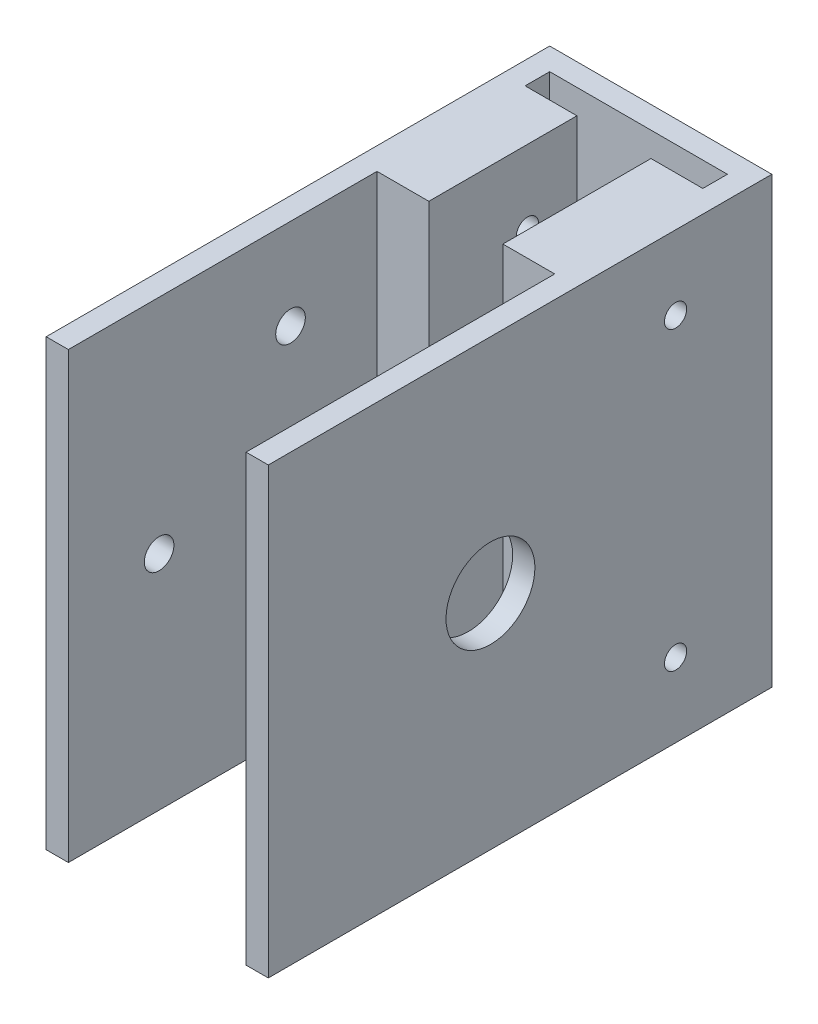
ISO-10303-21;
HEADER;
FILE_DESCRIPTION(('STEP AP214'),'2;1');
FILE_NAME('part.step','',(''),(''),'','','');
FILE_SCHEMA(('AUTOMOTIVE_DESIGN { 1 0 10303 214 1 1 1 1 }'));
ENDSEC;
DATA;
#1=APPLICATION_CONTEXT('core data for automotive mechanical design processes');
#2=APPLICATION_PROTOCOL_DEFINITION('international standard','automotive_design',2000,#1);
#3=PRODUCT_CONTEXT('',#1,'mechanical');
#4=PRODUCT('Part','Part','',(#3));
#5=PRODUCT_RELATED_PRODUCT_CATEGORY('part','',(#4));
#6=PRODUCT_DEFINITION_FORMATION('','',#4);
#7=PRODUCT_DEFINITION_CONTEXT('part definition',#1,'design');
#8=PRODUCT_DEFINITION('design','',#6,#7);
#9=PRODUCT_DEFINITION_SHAPE('','',#8);
#10=(LENGTH_UNIT() NAMED_UNIT(*) SI_UNIT(.MILLI.,.METRE.));
#11=(NAMED_UNIT(*) PLANE_ANGLE_UNIT() SI_UNIT($,.RADIAN.));
#12=(NAMED_UNIT(*) SI_UNIT($,.STERADIAN.) SOLID_ANGLE_UNIT());
#13=UNCERTAINTY_MEASURE_WITH_UNIT(LENGTH_MEASURE(1.E-05),#10,'distance_accuracy_value','');
#14=(GEOMETRIC_REPRESENTATION_CONTEXT(3) GLOBAL_UNCERTAINTY_ASSIGNED_CONTEXT((#13)) GLOBAL_UNIT_ASSIGNED_CONTEXT((#10,
#11,#12)) REPRESENTATION_CONTEXT('',''));
#15=CARTESIAN_POINT('',(0.,0.,0.));
#16=DIRECTION('',(0.,0.,1.));
#17=DIRECTION('',(1.,0.,0.));
#18=AXIS2_PLACEMENT_3D('',#15,#16,#17);
#19=CARTESIAN_POINT('',(-12.,30.,68.));
#20=DIRECTION('',(-1.,0.,0.));
#21=DIRECTION('',(0.,-1.,0.));
#22=AXIS2_PLACEMENT_3D('',#19,#20,#21);
#23=PLANE('',#22);
#24=DIRECTION('',(0.,1.,0.));
#25=VECTOR('',#24,1.);
#26=CARTESIAN_POINT('',(-12.,-51.1896201004171,6.32013899553956));
#27=LINE('',#26,#25);
#28=CARTESIAN_POINT('',(-12.,-30.,6.32013899553956));
#29=VERTEX_POINT('',#28);
#30=CARTESIAN_POINT('',(-12.,30.,6.32013899553956));
#31=VERTEX_POINT('',#30);
#32=EDGE_CURVE('E165',#29,#31,#27,.T.);
#33=ORIENTED_EDGE('',*,*,#32,.F.);
#34=DIRECTION('',(0.,0.,-1.));
#35=VECTOR('',#34,1.);
#36=CARTESIAN_POINT('',(-12.,-30.,68.));
#37=LINE('',#36,#35);
#38=CARTESIAN_POINT('',(-12.,-30.,3.));
#39=VERTEX_POINT('',#38);
#40=EDGE_CURVE('E253',#29,#39,#37,.T.);
#41=ORIENTED_EDGE('',*,*,#40,.T.);
#42=DIRECTION('',(0.,1.,0.));
#43=VECTOR('',#42,1.);
#44=CARTESIAN_POINT('',(-12.,30.,3.));
#45=LINE('',#44,#43);
#46=CARTESIAN_POINT('',(-12.,30.,3.));
#47=VERTEX_POINT('',#46);
#48=EDGE_CURVE('E239',#39,#47,#45,.T.);
#49=ORIENTED_EDGE('',*,*,#48,.T.);
#50=DIRECTION('',(0.,0.,-1.));
#51=VECTOR('',#50,1.);
#52=CARTESIAN_POINT('',(-12.,30.,68.));
#53=LINE('',#52,#51);
#54=EDGE_CURVE('E62',#31,#47,#53,.T.);
#55=ORIENTED_EDGE('',*,*,#54,.F.);
#56=EDGE_LOOP('',(#33,#41,#49,#55));
#57=FACE_BOUND('',#56,.T.);
#58=ADVANCED_FACE('F39',(#57),#23,.F.);
#59=CARTESIAN_POINT('',(12.,30.,68.));
#60=DIRECTION('',(1.,0.,0.));
#61=DIRECTION('',(0.,1.,0.));
#62=AXIS2_PLACEMENT_3D('',#59,#60,#61);
#63=PLANE('',#62);
#64=CARTESIAN_POINT('',(12.,0.,38.));
#65=DIRECTION('',(1.,0.,0.));
#66=DIRECTION('',(0.,1.,0.));
#67=AXIS2_PLACEMENT_3D('',#64,#65,#66);
#68=CIRCLE('',#67,6.00000000000001);
#69=CARTESIAN_POINT('',(12.,6.00000000000001,38.));
#70=VERTEX_POINT('',#69);
#71=EDGE_CURVE('E350',#70,#70,#68,.T.);
#72=ORIENTED_EDGE('',*,*,#71,.T.);
#73=EDGE_LOOP('',(#72));
#74=FACE_BOUND('',#73,.T.);
#75=DIRECTION('',(0.,1.,0.));
#76=VECTOR('',#75,1.);
#77=CARTESIAN_POINT('',(12.,-51.1896201004171,26.3201389955396));
#78=LINE('',#77,#76);
#79=CARTESIAN_POINT('',(12.,-30.,26.3201389955396));
#80=VERTEX_POINT('',#79);
#81=CARTESIAN_POINT('',(12.,30.,26.3201389955396));
#82=VERTEX_POINT('',#81);
#83=EDGE_CURVE('E212',#80,#82,#78,.T.);
#84=ORIENTED_EDGE('',*,*,#83,.F.);
#85=DIRECTION('',(0.,0.,-1.));
#86=VECTOR('',#85,1.);
#87=CARTESIAN_POINT('',(12.,-30.,68.));
#88=LINE('',#87,#86);
#89=CARTESIAN_POINT('',(12.,-30.,68.));
#90=VERTEX_POINT('',#89);
#91=EDGE_CURVE('E232',#90,#80,#88,.T.);
#92=ORIENTED_EDGE('',*,*,#91,.F.);
#93=DIRECTION('',(0.,-1.,0.));
#94=VECTOR('',#93,1.);
#95=CARTESIAN_POINT('',(12.,30.,68.));
#96=LINE('',#95,#94);
#97=CARTESIAN_POINT('',(12.,30.,68.));
#98=VERTEX_POINT('',#97);
#99=EDGE_CURVE('E224',#98,#90,#96,.T.);
#100=ORIENTED_EDGE('',*,*,#99,.F.);
#101=DIRECTION('',(0.,0.,-1.));
#102=VECTOR('',#101,1.);
#103=CARTESIAN_POINT('',(12.,30.,68.));
#104=LINE('',#103,#102);
#105=EDGE_CURVE('E236',#98,#82,#104,.T.);
#106=ORIENTED_EDGE('',*,*,#105,.T.);
#107=EDGE_LOOP('',(#84,#92,#100,#106));
#108=FACE_BOUND('',#107,.T.);
#109=ADVANCED_FACE('F313',(#74,#108),#63,.F.);
#110=CARTESIAN_POINT('',(0.,0.,3.));
#111=DIRECTION('',(0.,0.,1.));
#112=DIRECTION('',(1.,0.,0.));
#113=AXIS2_PLACEMENT_3D('',#110,#111,#112);
#114=PLANE('',#113);
#115=CARTESIAN_POINT('',(0.,15.,3.));
#116=DIRECTION('',(0.,0.,1.));
#117=DIRECTION('',(1.,0.,0.));
#118=AXIS2_PLACEMENT_3D('',#115,#116,#117);
#119=CIRCLE('',#118,2.9);
#120=CARTESIAN_POINT('',(2.9,15.,3.));
#121=VERTEX_POINT('',#120);
#122=EDGE_CURVE('E262',#121,#121,#119,.T.);
#123=ORIENTED_EDGE('',*,*,#122,.F.);
#124=EDGE_LOOP('',(#123));
#125=FACE_BOUND('',#124,.T.);
#126=CARTESIAN_POINT('',(0.,-15.,3.));
#127=DIRECTION('',(0.,0.,1.));
#128=DIRECTION('',(-1.,0.,0.));
#129=AXIS2_PLACEMENT_3D('',#126,#127,#128);
#130=CIRCLE('',#129,2.9);
#131=CARTESIAN_POINT('',(-2.9,-15.,3.));
#132=VERTEX_POINT('',#131);
#133=EDGE_CURVE('E256',#132,#132,#130,.T.);
#134=ORIENTED_EDGE('',*,*,#133,.F.);
#135=EDGE_LOOP('',(#134));
#136=FACE_BOUND('',#135,.T.);
#137=DIRECTION('',(1.,0.,0.));
#138=VECTOR('',#137,1.);
#139=CARTESIAN_POINT('',(-15.,-30.,3.));
#140=LINE('',#139,#138);
#141=CARTESIAN_POINT('',(12.,-30.,3.));
#142=VERTEX_POINT('',#141);
#143=EDGE_CURVE('E271',#39,#142,#140,.T.);
#144=ORIENTED_EDGE('',*,*,#143,.T.);
#145=DIRECTION('',(0.,-1.,0.));
#146=VECTOR('',#145,1.);
#147=CARTESIAN_POINT('',(12.,30.,3.));
#148=LINE('',#147,#146);
#149=CARTESIAN_POINT('',(12.,30.,3.));
#150=VERTEX_POINT('',#149);
#151=EDGE_CURVE('E218',#150,#142,#148,.T.);
#152=ORIENTED_EDGE('',*,*,#151,.F.);
#153=DIRECTION('',(-1.,0.,0.));
#154=VECTOR('',#153,1.);
#155=CARTESIAN_POINT('',(-15.,30.,3.));
#156=LINE('',#155,#154);
#157=EDGE_CURVE('E268',#150,#47,#156,.T.);
#158=ORIENTED_EDGE('',*,*,#157,.T.);
#159=ORIENTED_EDGE('',*,*,#48,.F.);
#160=EDGE_LOOP('',(#144,#152,#158,#159));
#161=FACE_BOUND('',#160,.T.);
#162=ADVANCED_FACE('F333',(#125,#136,#161),#114,.T.);
#163=CARTESIAN_POINT('',(0.,0.,0.));
#164=DIRECTION('',(0.,0.,1.));
#165=DIRECTION('',(1.,0.,0.));
#166=AXIS2_PLACEMENT_3D('',#163,#164,#165);
#167=PLANE('',#166);
#168=DIRECTION('',(0.,1.,0.));
#169=VECTOR('',#168,1.);
#170=CARTESIAN_POINT('',(15.,30.,0.));
#171=LINE('',#170,#169);
#172=CARTESIAN_POINT('',(15.,-30.,0.));
#173=VERTEX_POINT('',#172);
#174=CARTESIAN_POINT('',(15.,30.,0.));
#175=VERTEX_POINT('',#174);
#176=EDGE_CURVE('E265',#173,#175,#171,.T.);
#177=ORIENTED_EDGE('',*,*,#176,.F.);
#178=DIRECTION('',(1.,0.,0.));
#179=VECTOR('',#178,1.);
#180=CARTESIAN_POINT('',(-15.,-30.,0.));
#181=LINE('',#180,#179);
#182=CARTESIAN_POINT('',(-15.,-30.,0.));
#183=VERTEX_POINT('',#182);
#184=EDGE_CURVE('E272',#183,#173,#181,.T.);
#185=ORIENTED_EDGE('',*,*,#184,.F.);
#186=DIRECTION('',(0.,-1.,0.));
#187=VECTOR('',#186,1.);
#188=CARTESIAN_POINT('',(-15.,30.,0.));
#189=LINE('',#188,#187);
#190=CARTESIAN_POINT('',(-15.,30.,0.));
#191=VERTEX_POINT('',#190);
#192=EDGE_CURVE('E280',#191,#183,#189,.T.);
#193=ORIENTED_EDGE('',*,*,#192,.F.);
#194=DIRECTION('',(-1.,0.,0.));
#195=VECTOR('',#194,1.);
#196=CARTESIAN_POINT('',(-15.,30.,0.));
#197=LINE('',#196,#195);
#198=EDGE_CURVE('E278',#175,#191,#197,.T.);
#199=ORIENTED_EDGE('',*,*,#198,.F.);
#200=EDGE_LOOP('',(#177,#185,#193,#199));
#201=FACE_BOUND('',#200,.T.);
#202=CARTESIAN_POINT('',(0.,15.,0.));
#203=DIRECTION('',(0.,0.,1.));
#204=DIRECTION('',(1.,0.,0.));
#205=AXIS2_PLACEMENT_3D('',#202,#203,#204);
#206=CIRCLE('',#205,2.9);
#207=CARTESIAN_POINT('',(2.9,15.,0.));
#208=VERTEX_POINT('',#207);
#209=EDGE_CURVE('E259',#208,#208,#206,.T.);
#210=ORIENTED_EDGE('',*,*,#209,.T.);
#211=EDGE_LOOP('',(#210));
#212=FACE_BOUND('',#211,.T.);
#213=CARTESIAN_POINT('',(0.,-15.,0.));
#214=DIRECTION('',(0.,0.,1.));
#215=DIRECTION('',(-1.,0.,0.));
#216=AXIS2_PLACEMENT_3D('',#213,#214,#215);
#217=CIRCLE('',#216,2.9);
#218=CARTESIAN_POINT('',(-2.9,-15.,0.));
#219=VERTEX_POINT('',#218);
#220=EDGE_CURVE('E255',#219,#219,#217,.T.);
#221=ORIENTED_EDGE('',*,*,#220,.T.);
#222=EDGE_LOOP('',(#221));
#223=FACE_BOUND('',#222,.T.);
#224=ADVANCED_FACE('F296',(#201,#212,#223),#167,.F.);
#225=CARTESIAN_POINT('',(15.,30.,3.));
#226=DIRECTION('',(-1.,0.,0.));
#227=DIRECTION('',(0.,-1.,0.));
#228=AXIS2_PLACEMENT_3D('',#225,#226,#227);
#229=PLANE('',#228);
#230=CARTESIAN_POINT('',(15.,-20.,13.));
#231=DIRECTION('',(-1.,0.,0.));
#232=DIRECTION('',(0.,-1.,0.));
#233=AXIS2_PLACEMENT_3D('',#230,#231,#232);
#234=CIRCLE('',#233,1.5);
#235=CARTESIAN_POINT('',(15.,-21.5,13.));
#236=VERTEX_POINT('',#235);
#237=EDGE_CURVE('E387',#236,#236,#234,.T.);
#238=ORIENTED_EDGE('',*,*,#237,.T.);
#239=EDGE_LOOP('',(#238));
#240=FACE_BOUND('',#239,.T.);
#241=CARTESIAN_POINT('',(15.,20.,13.));
#242=DIRECTION('',(-1.,0.,0.));
#243=DIRECTION('',(0.,-1.,0.));
#244=AXIS2_PLACEMENT_3D('',#241,#242,#243);
#245=CIRCLE('',#244,1.5);
#246=CARTESIAN_POINT('',(15.,18.5,13.));
#247=VERTEX_POINT('',#246);
#248=EDGE_CURVE('E391',#247,#247,#245,.T.);
#249=ORIENTED_EDGE('',*,*,#248,.T.);
#250=EDGE_LOOP('',(#249));
#251=FACE_BOUND('',#250,.T.);
#252=CARTESIAN_POINT('',(15.,0.,38.));
#253=DIRECTION('',(-1.,0.,0.));
#254=DIRECTION('',(0.,-1.,0.));
#255=AXIS2_PLACEMENT_3D('',#252,#253,#254);
#256=CIRCLE('',#255,6.00000000000001);
#257=CARTESIAN_POINT('',(15.,-6.00000000000001,38.));
#258=VERTEX_POINT('',#257);
#259=EDGE_CURVE('E388',#258,#258,#256,.T.);
#260=ORIENTED_EDGE('',*,*,#259,.T.);
#261=EDGE_LOOP('',(#260));
#262=FACE_BOUND('',#261,.T.);
#263=ORIENTED_EDGE('',*,*,#176,.T.);
#264=DIRECTION('',(0.,0.,-1.));
#265=VECTOR('',#264,1.);
#266=CARTESIAN_POINT('',(15.,30.,3.));
#267=LINE('',#266,#265);
#268=CARTESIAN_POINT('',(15.,30.,68.));
#269=VERTEX_POINT('',#268);
#270=EDGE_CURVE('E11',#269,#175,#267,.T.);
#271=ORIENTED_EDGE('',*,*,#270,.F.);
#272=DIRECTION('',(0.,1.,0.));
#273=VECTOR('',#272,1.);
#274=CARTESIAN_POINT('',(15.,30.,68.));
#275=LINE('',#274,#273);
#276=CARTESIAN_POINT('',(15.,-30.,68.));
#277=VERTEX_POINT('',#276);
#278=EDGE_CURVE('E219',#277,#269,#275,.T.);
#279=ORIENTED_EDGE('',*,*,#278,.F.);
#280=DIRECTION('',(0.,0.,-1.));
#281=VECTOR('',#280,1.);
#282=CARTESIAN_POINT('',(15.,-30.,3.));
#283=LINE('',#282,#281);
#284=EDGE_CURVE('E275',#277,#173,#283,.T.);
#285=ORIENTED_EDGE('',*,*,#284,.T.);
#286=EDGE_LOOP('',(#263,#271,#279,#285));
#287=FACE_BOUND('',#286,.T.);
#288=ADVANCED_FACE('F41',(#240,#251,#262,#287),#229,.F.);
#289=CARTESIAN_POINT('',(-15.,30.,3.));
#290=DIRECTION('',(0.,-1.,0.));
#291=DIRECTION('',(0.,0.,-1.));
#292=AXIS2_PLACEMENT_3D('',#289,#290,#291);
#293=PLANE('',#292);
#294=ORIENTED_EDGE('',*,*,#198,.T.);
#295=DIRECTION('',(0.,0.,-1.));
#296=VECTOR('',#295,1.);
#297=CARTESIAN_POINT('',(-15.,30.,3.));
#298=LINE('',#297,#296);
#299=CARTESIAN_POINT('',(-15.,30.,68.));
#300=VERTEX_POINT('',#299);
#301=EDGE_CURVE('E47',#300,#191,#298,.T.);
#302=ORIENTED_EDGE('',*,*,#301,.F.);
#303=DIRECTION('',(-1.,0.,0.));
#304=VECTOR('',#303,1.);
#305=CARTESIAN_POINT('',(-15.,30.,68.));
#306=LINE('',#305,#304);
#307=CARTESIAN_POINT('',(-12.,30.,68.));
#308=VERTEX_POINT('',#307);
#309=EDGE_CURVE('E247',#308,#300,#306,.T.);
#310=ORIENTED_EDGE('',*,*,#309,.F.);
#311=CARTESIAN_POINT('',(-12.,30.,26.3201389955396));
#312=VERTEX_POINT('',#311);
#313=EDGE_CURVE('E251',#308,#312,#53,.T.);
#314=ORIENTED_EDGE('',*,*,#313,.T.);
#315=DIRECTION('',(1.,0.,0.));
#316=VECTOR('',#315,1.);
#317=CARTESIAN_POINT('',(0.,30.,26.3201389955396));
#318=LINE('',#317,#316);
#319=CARTESIAN_POINT('',(-5.,30.,26.3201389955396));
#320=VERTEX_POINT('',#319);
#321=EDGE_CURVE('E166',#312,#320,#318,.T.);
#322=ORIENTED_EDGE('',*,*,#321,.T.);
#323=DIRECTION('',(0.,0.,1.));
#324=VECTOR('',#323,1.);
#325=CARTESIAN_POINT('',(-5.,30.,0.));
#326=LINE('',#325,#324);
#327=CARTESIAN_POINT('',(-5.,30.,6.32013899553957));
#328=VERTEX_POINT('',#327);
#329=EDGE_CURVE('E160',#328,#320,#326,.T.);
#330=ORIENTED_EDGE('',*,*,#329,.F.);
#331=DIRECTION('',(1.,0.,0.));
#332=VECTOR('',#331,1.);
#333=CARTESIAN_POINT('',(0.,30.,6.32013899553957));
#334=LINE('',#333,#332);
#335=EDGE_CURVE('E169',#31,#328,#334,.T.);
#336=ORIENTED_EDGE('',*,*,#335,.F.);
#337=ORIENTED_EDGE('',*,*,#54,.T.);
#338=ORIENTED_EDGE('',*,*,#157,.F.);
#339=CARTESIAN_POINT('',(12.,30.,6.32013899553956));
#340=VERTEX_POINT('',#339);
#341=EDGE_CURVE('E235',#340,#150,#104,.T.);
#342=ORIENTED_EDGE('',*,*,#341,.F.);
#343=DIRECTION('',(-1.,0.,0.));
#344=VECTOR('',#343,1.);
#345=CARTESIAN_POINT('',(0.,30.,6.32013899553957));
#346=LINE('',#345,#344);
#347=CARTESIAN_POINT('',(5.,30.,6.32013899553957));
#348=VERTEX_POINT('',#347);
#349=EDGE_CURVE('E200',#340,#348,#346,.T.);
#350=ORIENTED_EDGE('',*,*,#349,.T.);
#351=DIRECTION('',(0.,0.,1.));
#352=VECTOR('',#351,1.);
#353=CARTESIAN_POINT('',(5.,30.,0.));
#354=LINE('',#353,#352);
#355=CARTESIAN_POINT('',(5.,30.,26.3201389955396));
#356=VERTEX_POINT('',#355);
#357=EDGE_CURVE('E203',#348,#356,#354,.T.);
#358=ORIENTED_EDGE('',*,*,#357,.T.);
#359=DIRECTION('',(-1.,0.,0.));
#360=VECTOR('',#359,1.);
#361=CARTESIAN_POINT('',(0.,30.,26.3201389955396));
#362=LINE('',#361,#360);
#363=EDGE_CURVE('E206',#82,#356,#362,.T.);
#364=ORIENTED_EDGE('',*,*,#363,.F.);
#365=ORIENTED_EDGE('',*,*,#105,.F.);
#366=DIRECTION('',(-1.,0.,0.));
#367=VECTOR('',#366,1.);
#368=CARTESIAN_POINT('',(15.,30.,68.));
#369=LINE('',#368,#367);
#370=EDGE_CURVE('E222',#269,#98,#369,.T.);
#371=ORIENTED_EDGE('',*,*,#370,.F.);
#372=ORIENTED_EDGE('',*,*,#270,.T.);
#373=EDGE_LOOP('',(#294,#302,#310,#314,#322,#330,#336,#337,#338,#342,#350,#358,#364,#365,#371,#372));
#374=FACE_BOUND('',#373,.T.);
#375=ADVANCED_FACE('F173',(#374),#293,.F.);
#376=CARTESIAN_POINT('',(-15.,30.,3.));
#377=DIRECTION('',(1.,0.,0.));
#378=DIRECTION('',(0.,1.,0.));
#379=AXIS2_PLACEMENT_3D('',#376,#377,#378);
#380=PLANE('',#379);
#381=CARTESIAN_POINT('',(-15.,-20.,13.));
#382=DIRECTION('',(-1.,0.,0.));
#383=DIRECTION('',(0.,1.,0.));
#384=AXIS2_PLACEMENT_3D('',#381,#382,#383);
#385=CIRCLE('',#384,1.5);
#386=CARTESIAN_POINT('',(-15.,-18.5,13.));
#387=VERTEX_POINT('',#386);
#388=EDGE_CURVE('E347',#387,#387,#385,.T.);
#389=ORIENTED_EDGE('',*,*,#388,.F.);
#390=EDGE_LOOP('',(#389));
#391=FACE_BOUND('',#390,.T.);
#392=CARTESIAN_POINT('',(-15.,-17.75,37.9999999999998));
#393=DIRECTION('',(-1.,0.,0.));
#394=DIRECTION('',(0.,-1.,0.));
#395=AXIS2_PLACEMENT_3D('',#392,#393,#394);
#396=CIRCLE('',#395,2.);
#397=CARTESIAN_POINT('',(-15.,-19.75,37.9999999999998));
#398=VERTEX_POINT('',#397);
#399=EDGE_CURVE('E351',#398,#398,#396,.T.);
#400=ORIENTED_EDGE('',*,*,#399,.F.);
#401=EDGE_LOOP('',(#400));
#402=FACE_BOUND('',#401,.T.);
#403=CARTESIAN_POINT('',(-15.,0.,38.));
#404=DIRECTION('',(-1.,0.,0.));
#405=DIRECTION('',(0.,-1.,0.));
#406=AXIS2_PLACEMENT_3D('',#403,#404,#405);
#407=CIRCLE('',#406,6.00000000000001);
#408=CARTESIAN_POINT('',(-15.,-6.00000000000001,38.));
#409=VERTEX_POINT('',#408);
#410=EDGE_CURVE('E342',#409,#409,#407,.T.);
#411=ORIENTED_EDGE('',*,*,#410,.F.);
#412=EDGE_LOOP('',(#411));
#413=FACE_BOUND('',#412,.T.);
#414=CARTESIAN_POINT('',(-15.,0.,20.25));
#415=DIRECTION('',(-1.,0.,0.));
#416=DIRECTION('',(0.,-1.,0.));
#417=AXIS2_PLACEMENT_3D('',#414,#415,#416);
#418=CIRCLE('',#417,2.);
#419=CARTESIAN_POINT('',(-15.,-2.,20.25));
#420=VERTEX_POINT('',#419);
#421=EDGE_CURVE('E361',#420,#420,#418,.T.);
#422=ORIENTED_EDGE('',*,*,#421,.F.);
#423=EDGE_LOOP('',(#422));
#424=FACE_BOUND('',#423,.T.);
#425=CARTESIAN_POINT('',(-15.,17.75,38.0000000000001));
#426=DIRECTION('',(-1.,0.,0.));
#427=DIRECTION('',(0.,-1.,0.));
#428=AXIS2_PLACEMENT_3D('',#425,#426,#427);
#429=CIRCLE('',#428,2.);
#430=CARTESIAN_POINT('',(-15.,15.75,38.0000000000001));
#431=VERTEX_POINT('',#430);
#432=EDGE_CURVE('E364',#431,#431,#429,.T.);
#433=ORIENTED_EDGE('',*,*,#432,.F.);
#434=EDGE_LOOP('',(#433));
#435=FACE_BOUND('',#434,.T.);
#436=CARTESIAN_POINT('',(-15.,-1.25682311004908E-13,55.75));
#437=DIRECTION('',(-1.,0.,0.));
#438=DIRECTION('',(0.,-1.,0.));
#439=AXIS2_PLACEMENT_3D('',#436,#437,#438);
#440=CIRCLE('',#439,2.);
#441=CARTESIAN_POINT('',(-15.,-2.00000000000012,55.75));
#442=VERTEX_POINT('',#441);
#443=EDGE_CURVE('E369',#442,#442,#440,.T.);
#444=ORIENTED_EDGE('',*,*,#443,.F.);
#445=EDGE_LOOP('',(#444));
#446=FACE_BOUND('',#445,.T.);
#447=CARTESIAN_POINT('',(-15.,20.,13.));
#448=DIRECTION('',(-1.,0.,0.));
#449=DIRECTION('',(0.,-1.,0.));
#450=AXIS2_PLACEMENT_3D('',#447,#448,#449);
#451=CIRCLE('',#450,1.5);
#452=CARTESIAN_POINT('',(-15.,18.5,13.));
#453=VERTEX_POINT('',#452);
#454=EDGE_CURVE('E179',#453,#453,#451,.T.);
#455=ORIENTED_EDGE('',*,*,#454,.F.);
#456=EDGE_LOOP('',(#455));
#457=FACE_BOUND('',#456,.T.);
#458=ORIENTED_EDGE('',*,*,#192,.T.);
#459=DIRECTION('',(0.,0.,-1.));
#460=VECTOR('',#459,1.);
#461=CARTESIAN_POINT('',(-15.,-30.,3.));
#462=LINE('',#461,#460);
#463=CARTESIAN_POINT('',(-15.,-30.,68.));
#464=VERTEX_POINT('',#463);
#465=EDGE_CURVE('E285',#464,#183,#462,.T.);
#466=ORIENTED_EDGE('',*,*,#465,.F.);
#467=DIRECTION('',(0.,-1.,0.));
#468=VECTOR('',#467,1.);
#469=CARTESIAN_POINT('',(-15.,30.,68.));
#470=LINE('',#469,#468);
#471=EDGE_CURVE('E240',#300,#464,#470,.T.);
#472=ORIENTED_EDGE('',*,*,#471,.F.);
#473=ORIENTED_EDGE('',*,*,#301,.T.);
#474=EDGE_LOOP('',(#458,#466,#472,#473));
#475=FACE_BOUND('',#474,.T.);
#476=ADVANCED_FACE('F291',(#391,#402,#413,#424,#435,#446,#457,#475),#380,.F.);
#477=CARTESIAN_POINT('',(-15.,-30.,3.));
#478=DIRECTION('',(0.,1.,0.));
#479=DIRECTION('',(0.,0.,1.));
#480=AXIS2_PLACEMENT_3D('',#477,#478,#479);
#481=PLANE('',#480);
#482=ORIENTED_EDGE('',*,*,#184,.T.);
#483=ORIENTED_EDGE('',*,*,#284,.F.);
#484=DIRECTION('',(1.,0.,0.));
#485=VECTOR('',#484,1.);
#486=CARTESIAN_POINT('',(15.,-30.,68.));
#487=LINE('',#486,#485);
#488=EDGE_CURVE('E226',#90,#277,#487,.T.);
#489=ORIENTED_EDGE('',*,*,#488,.F.);
#490=ORIENTED_EDGE('',*,*,#91,.T.);
#491=DIRECTION('',(1.,0.,0.));
#492=VECTOR('',#491,1.);
#493=CARTESIAN_POINT('',(0.,-30.,26.3201389955396));
#494=LINE('',#493,#492);
#495=CARTESIAN_POINT('',(5.,-30.,26.3201389955396));
#496=VERTEX_POINT('',#495);
#497=EDGE_CURVE('E193',#496,#80,#494,.T.);
#498=ORIENTED_EDGE('',*,*,#497,.F.);
#499=DIRECTION('',(0.,0.,-1.));
#500=VECTOR('',#499,1.);
#501=CARTESIAN_POINT('',(5.,-30.,0.));
#502=LINE('',#501,#500);
#503=CARTESIAN_POINT('',(5.,-30.,6.32013899553957));
#504=VERTEX_POINT('',#503);
#505=EDGE_CURVE('E199',#496,#504,#502,.T.);
#506=ORIENTED_EDGE('',*,*,#505,.T.);
#507=DIRECTION('',(1.,0.,0.));
#508=VECTOR('',#507,1.);
#509=CARTESIAN_POINT('',(0.,-30.,6.32013899553957));
#510=LINE('',#509,#508);
#511=CARTESIAN_POINT('',(12.,-30.,6.32013899553956));
#512=VERTEX_POINT('',#511);
#513=EDGE_CURVE('E195',#504,#512,#510,.T.);
#514=ORIENTED_EDGE('',*,*,#513,.T.);
#515=EDGE_CURVE('E229',#512,#142,#88,.T.);
#516=ORIENTED_EDGE('',*,*,#515,.T.);
#517=ORIENTED_EDGE('',*,*,#143,.F.);
#518=ORIENTED_EDGE('',*,*,#40,.F.);
#519=DIRECTION('',(-1.,0.,0.));
#520=VECTOR('',#519,1.);
#521=CARTESIAN_POINT('',(0.,-30.,6.32013899553957));
#522=LINE('',#521,#520);
#523=CARTESIAN_POINT('',(-5.,-30.,6.32013899553957));
#524=VERTEX_POINT('',#523);
#525=EDGE_CURVE('E187',#524,#29,#522,.T.);
#526=ORIENTED_EDGE('',*,*,#525,.F.);
#527=DIRECTION('',(0.,0.,-1.));
#528=VECTOR('',#527,1.);
#529=CARTESIAN_POINT('',(-5.,-30.,0.));
#530=LINE('',#529,#528);
#531=CARTESIAN_POINT('',(-5.,-30.,26.3201389955396));
#532=VERTEX_POINT('',#531);
#533=EDGE_CURVE('E162',#532,#524,#530,.T.);
#534=ORIENTED_EDGE('',*,*,#533,.F.);
#535=DIRECTION('',(-1.,0.,0.));
#536=VECTOR('',#535,1.);
#537=CARTESIAN_POINT('',(0.,-30.,26.3201389955396));
#538=LINE('',#537,#536);
#539=CARTESIAN_POINT('',(-12.,-30.,26.3201389955396));
#540=VERTEX_POINT('',#539);
#541=EDGE_CURVE('E192',#532,#540,#538,.T.);
#542=ORIENTED_EDGE('',*,*,#541,.T.);
#543=CARTESIAN_POINT('',(-12.,-30.,68.));
#544=VERTEX_POINT('',#543);
#545=EDGE_CURVE('E54',#544,#540,#37,.T.);
#546=ORIENTED_EDGE('',*,*,#545,.F.);
#547=DIRECTION('',(1.,0.,0.));
#548=VECTOR('',#547,1.);
#549=CARTESIAN_POINT('',(-15.,-30.,68.));
#550=LINE('',#549,#548);
#551=EDGE_CURVE('E243',#464,#544,#550,.T.);
#552=ORIENTED_EDGE('',*,*,#551,.F.);
#553=ORIENTED_EDGE('',*,*,#465,.T.);
#554=EDGE_LOOP('',(#482,#483,#489,#490,#498,#506,#514,#516,#517,#518,#526,#534,#542,#546,#552,#553));
#555=FACE_BOUND('',#554,.T.);
#556=ADVANCED_FACE('F299',(#555),#481,.F.);
#557=CARTESIAN_POINT('',(0.,15.,3.));
#558=DIRECTION('',(0.,0.,-1.));
#559=DIRECTION('',(-1.,0.,0.));
#560=AXIS2_PLACEMENT_3D('',#557,#558,#559);
#561=CYLINDRICAL_SURFACE('',#560,2.9);
#562=ORIENTED_EDGE('',*,*,#122,.T.);
#563=EDGE_LOOP('',(#562));
#564=FACE_BOUND('',#563,.T.);
#565=ORIENTED_EDGE('',*,*,#209,.F.);
#566=EDGE_LOOP('',(#565));
#567=FACE_BOUND('',#566,.T.);
#568=ADVANCED_FACE('F433',(#564,#567),#561,.F.);
#569=CARTESIAN_POINT('',(0.,-15.,3.));
#570=DIRECTION('',(0.,0.,-1.));
#571=DIRECTION('',(-1.,0.,0.));
#572=AXIS2_PLACEMENT_3D('',#569,#570,#571);
#573=CYLINDRICAL_SURFACE('',#572,2.9);
#574=ORIENTED_EDGE('',*,*,#133,.T.);
#575=EDGE_LOOP('',(#574));
#576=FACE_BOUND('',#575,.T.);
#577=ORIENTED_EDGE('',*,*,#220,.F.);
#578=EDGE_LOOP('',(#577));
#579=FACE_BOUND('',#578,.T.);
#580=ADVANCED_FACE('F426',(#576,#579),#573,.F.);
#581=CARTESIAN_POINT('',(-12.,-17.75,37.9999999999998));
#582=DIRECTION('',(-1.,0.,0.));
#583=DIRECTION('',(0.,-1.,0.));
#584=AXIS2_PLACEMENT_3D('',#581,#582,#583);
#585=CIRCLE('',#584,2.);
#586=CARTESIAN_POINT('',(-12.,-19.75,37.9999999999998));
#587=VERTEX_POINT('',#586);
#588=EDGE_CURVE('E346',#587,#587,#585,.F.);
#589=ORIENTED_EDGE('',*,*,#588,.F.);
#590=EDGE_LOOP('',(#589));
#591=FACE_BOUND('',#590,.T.);
#592=CARTESIAN_POINT('',(-12.,0.,38.));
#593=DIRECTION('',(-1.,0.,0.));
#594=DIRECTION('',(0.,-1.,0.));
#595=AXIS2_PLACEMENT_3D('',#592,#593,#594);
#596=CIRCLE('',#595,6.00000000000001);
#597=CARTESIAN_POINT('',(-12.,-6.00000000000001,38.));
#598=VERTEX_POINT('',#597);
#599=EDGE_CURVE('E360',#598,#598,#596,.F.);
#600=ORIENTED_EDGE('',*,*,#599,.F.);
#601=EDGE_LOOP('',(#600));
#602=FACE_BOUND('',#601,.T.);
#603=CARTESIAN_POINT('',(-12.,17.75,38.0000000000001));
#604=DIRECTION('',(-1.,0.,0.));
#605=DIRECTION('',(0.,-1.,0.));
#606=AXIS2_PLACEMENT_3D('',#603,#604,#605);
#607=CIRCLE('',#606,2.);
#608=CARTESIAN_POINT('',(-12.,15.75,38.0000000000001));
#609=VERTEX_POINT('',#608);
#610=EDGE_CURVE('E372',#609,#609,#607,.F.);
#611=ORIENTED_EDGE('',*,*,#610,.F.);
#612=EDGE_LOOP('',(#611));
#613=FACE_BOUND('',#612,.T.);
#614=CARTESIAN_POINT('',(-12.,-1.25335366309713E-13,55.75));
#615=DIRECTION('',(-1.,0.,0.));
#616=DIRECTION('',(0.,-1.,0.));
#617=AXIS2_PLACEMENT_3D('',#614,#615,#616);
#618=CIRCLE('',#617,2.);
#619=CARTESIAN_POINT('',(-12.,-2.00000000000012,55.75));
#620=VERTEX_POINT('',#619);
#621=EDGE_CURVE('E354',#620,#620,#618,.F.);
#622=ORIENTED_EDGE('',*,*,#621,.F.);
#623=EDGE_LOOP('',(#622));
#624=FACE_BOUND('',#623,.T.);
#625=ORIENTED_EDGE('',*,*,#545,.T.);
#626=DIRECTION('',(0.,1.,0.));
#627=VECTOR('',#626,1.);
#628=CARTESIAN_POINT('',(-12.,-51.1896201004171,26.3201389955396));
#629=LINE('',#628,#627);
#630=EDGE_CURVE('E188',#540,#312,#629,.T.);
#631=ORIENTED_EDGE('',*,*,#630,.T.);
#632=ORIENTED_EDGE('',*,*,#313,.F.);
#633=DIRECTION('',(0.,1.,0.));
#634=VECTOR('',#633,1.);
#635=CARTESIAN_POINT('',(-12.,30.,68.));
#636=LINE('',#635,#634);
#637=EDGE_CURVE('E245',#544,#308,#636,.T.);
#638=ORIENTED_EDGE('',*,*,#637,.F.);
#639=EDGE_LOOP('',(#625,#631,#632,#638));
#640=FACE_BOUND('',#639,.T.);
#641=ADVANCED_FACE('F416',(#591,#602,#613,#624,#640),#23,.F.);
#642=CARTESIAN_POINT('',(0.,0.,68.));
#643=DIRECTION('',(0.,0.,1.));
#644=DIRECTION('',(1.,0.,0.));
#645=AXIS2_PLACEMENT_3D('',#642,#643,#644);
#646=PLANE('',#645);
#647=ORIENTED_EDGE('',*,*,#471,.T.);
#648=ORIENTED_EDGE('',*,*,#551,.T.);
#649=ORIENTED_EDGE('',*,*,#637,.T.);
#650=ORIENTED_EDGE('',*,*,#309,.T.);
#651=EDGE_LOOP('',(#647,#648,#649,#650));
#652=FACE_BOUND('',#651,.T.);
#653=ADVANCED_FACE('F425',(#652),#646,.T.);
#654=ORIENTED_EDGE('',*,*,#515,.F.);
#655=DIRECTION('',(0.,1.,0.));
#656=VECTOR('',#655,1.);
#657=CARTESIAN_POINT('',(12.,-51.1896201004171,6.32013899553956));
#658=LINE('',#657,#656);
#659=EDGE_CURVE('E196',#512,#340,#658,.T.);
#660=ORIENTED_EDGE('',*,*,#659,.T.);
#661=ORIENTED_EDGE('',*,*,#341,.T.);
#662=ORIENTED_EDGE('',*,*,#151,.T.);
#663=EDGE_LOOP('',(#654,#660,#661,#662));
#664=FACE_BOUND('',#663,.T.);
#665=ADVANCED_FACE('F328',(#664),#63,.F.);
#666=CARTESIAN_POINT('',(0.,0.,68.));
#667=DIRECTION('',(0.,0.,-1.));
#668=DIRECTION('',(-1.,0.,0.));
#669=AXIS2_PLACEMENT_3D('',#666,#667,#668);
#670=PLANE('',#669);
#671=ORIENTED_EDGE('',*,*,#278,.T.);
#672=ORIENTED_EDGE('',*,*,#370,.T.);
#673=ORIENTED_EDGE('',*,*,#99,.T.);
#674=ORIENTED_EDGE('',*,*,#488,.T.);
#675=EDGE_LOOP('',(#671,#672,#673,#674));
#676=FACE_BOUND('',#675,.T.);
#677=ADVANCED_FACE('F306',(#676),#670,.F.);
#678=CARTESIAN_POINT('',(0.,-51.1896201004171,6.32013899553957));
#679=DIRECTION('',(0.,0.,-1.));
#680=DIRECTION('',(-1.,0.,0.));
#681=AXIS2_PLACEMENT_3D('',#678,#679,#680);
#682=PLANE('',#681);
#683=ORIENTED_EDGE('',*,*,#513,.F.);
#684=DIRECTION('',(0.,1.,0.));
#685=VECTOR('',#684,1.);
#686=CARTESIAN_POINT('',(5.,-51.1896201004171,6.32013899553957));
#687=LINE('',#686,#685);
#688=EDGE_CURVE('E209',#504,#348,#687,.T.);
#689=ORIENTED_EDGE('',*,*,#688,.T.);
#690=ORIENTED_EDGE('',*,*,#349,.F.);
#691=ORIENTED_EDGE('',*,*,#659,.F.);
#692=EDGE_LOOP('',(#683,#689,#690,#691));
#693=FACE_BOUND('',#692,.T.);
#694=ADVANCED_FACE('F326',(#693),#682,.T.);
#695=CARTESIAN_POINT('',(0.,-51.1896201004171,26.3201389955396));
#696=DIRECTION('',(0.,0.,-1.));
#697=DIRECTION('',(-1.,0.,0.));
#698=AXIS2_PLACEMENT_3D('',#695,#696,#697);
#699=PLANE('',#698);
#700=DIRECTION('',(0.,1.,0.));
#701=VECTOR('',#700,1.);
#702=CARTESIAN_POINT('',(5.,-51.1896201004171,26.3201389955396));
#703=LINE('',#702,#701);
#704=EDGE_CURVE('E214',#496,#356,#703,.T.);
#705=ORIENTED_EDGE('',*,*,#704,.F.);
#706=ORIENTED_EDGE('',*,*,#497,.T.);
#707=ORIENTED_EDGE('',*,*,#83,.T.);
#708=ORIENTED_EDGE('',*,*,#363,.T.);
#709=EDGE_LOOP('',(#705,#706,#707,#708));
#710=FACE_BOUND('',#709,.T.);
#711=ADVANCED_FACE('F316',(#710),#699,.F.);
#712=CARTESIAN_POINT('',(5.,-51.1896201004171,0.));
#713=DIRECTION('',(-1.,0.,0.));
#714=DIRECTION('',(0.,0.,1.));
#715=AXIS2_PLACEMENT_3D('',#712,#713,#714);
#716=PLANE('',#715);
#717=CARTESIAN_POINT('',(5.,-20.,13.));
#718=DIRECTION('',(-1.,0.,0.));
#719=DIRECTION('',(0.,0.,1.));
#720=AXIS2_PLACEMENT_3D('',#717,#718,#719);
#721=CIRCLE('',#720,1.5);
#722=CARTESIAN_POINT('',(5.,-20.,14.5));
#723=VERTEX_POINT('',#722);
#724=EDGE_CURVE('E381',#723,#723,#721,.T.);
#725=ORIENTED_EDGE('',*,*,#724,.F.);
#726=EDGE_LOOP('',(#725));
#727=FACE_BOUND('',#726,.T.);
#728=CARTESIAN_POINT('',(5.,20.,13.));
#729=DIRECTION('',(-1.,0.,0.));
#730=DIRECTION('',(0.,0.,1.));
#731=AXIS2_PLACEMENT_3D('',#728,#729,#730);
#732=CIRCLE('',#731,1.5);
#733=CARTESIAN_POINT('',(5.,20.,14.5));
#734=VERTEX_POINT('',#733);
#735=EDGE_CURVE('E384',#734,#734,#732,.T.);
#736=ORIENTED_EDGE('',*,*,#735,.F.);
#737=EDGE_LOOP('',(#736));
#738=FACE_BOUND('',#737,.T.);
#739=ORIENTED_EDGE('',*,*,#505,.F.);
#740=ORIENTED_EDGE('',*,*,#704,.T.);
#741=ORIENTED_EDGE('',*,*,#357,.F.);
#742=ORIENTED_EDGE('',*,*,#688,.F.);
#743=EDGE_LOOP('',(#739,#740,#741,#742));
#744=FACE_BOUND('',#743,.T.);
#745=ADVANCED_FACE('F322',(#727,#738,#744),#716,.T.);
#746=CARTESIAN_POINT('',(0.,-51.1896201004171,6.32013899553957));
#747=DIRECTION('',(0.,0.,1.));
#748=DIRECTION('',(1.,0.,0.));
#749=AXIS2_PLACEMENT_3D('',#746,#747,#748);
#750=PLANE('',#749);
#751=DIRECTION('',(0.,1.,0.));
#752=VECTOR('',#751,1.);
#753=CARTESIAN_POINT('',(-5.,-51.1896201004171,6.32013899553957));
#754=LINE('',#753,#752);
#755=EDGE_CURVE('E155',#524,#328,#754,.T.);
#756=ORIENTED_EDGE('',*,*,#755,.F.);
#757=ORIENTED_EDGE('',*,*,#525,.T.);
#758=ORIENTED_EDGE('',*,*,#32,.T.);
#759=ORIENTED_EDGE('',*,*,#335,.T.);
#760=EDGE_LOOP('',(#756,#757,#758,#759));
#761=FACE_BOUND('',#760,.T.);
#762=ADVANCED_FACE('F170',(#761),#750,.F.);
#763=CARTESIAN_POINT('',(0.,-51.1896201004171,26.3201389955396));
#764=DIRECTION('',(0.,0.,1.));
#765=DIRECTION('',(1.,0.,0.));
#766=AXIS2_PLACEMENT_3D('',#763,#764,#765);
#767=PLANE('',#766);
#768=ORIENTED_EDGE('',*,*,#541,.F.);
#769=DIRECTION('',(0.,1.,0.));
#770=VECTOR('',#769,1.);
#771=CARTESIAN_POINT('',(-5.,-51.1896201004171,26.3201389955396));
#772=LINE('',#771,#770);
#773=EDGE_CURVE('E185',#532,#320,#772,.T.);
#774=ORIENTED_EDGE('',*,*,#773,.T.);
#775=ORIENTED_EDGE('',*,*,#321,.F.);
#776=ORIENTED_EDGE('',*,*,#630,.F.);
#777=EDGE_LOOP('',(#768,#774,#775,#776));
#778=FACE_BOUND('',#777,.T.);
#779=ADVANCED_FACE('F338',(#778),#767,.T.);
#780=CARTESIAN_POINT('',(-5.,-51.1896201004171,0.));
#781=DIRECTION('',(-1.,0.,0.));
#782=DIRECTION('',(0.,0.,1.));
#783=AXIS2_PLACEMENT_3D('',#780,#781,#782);
#784=PLANE('',#783);
#785=CARTESIAN_POINT('',(-5.,-20.,13.));
#786=DIRECTION('',(-1.,0.,0.));
#787=DIRECTION('',(0.,0.,1.));
#788=AXIS2_PLACEMENT_3D('',#785,#786,#787);
#789=CIRCLE('',#788,1.5);
#790=CARTESIAN_POINT('',(-5.,-20.,14.5));
#791=VERTEX_POINT('',#790);
#792=EDGE_CURVE('E343',#791,#791,#789,.F.);
#793=ORIENTED_EDGE('',*,*,#792,.F.);
#794=EDGE_LOOP('',(#793));
#795=FACE_BOUND('',#794,.T.);
#796=CARTESIAN_POINT('',(-5.,0.,20.25));
#797=DIRECTION('',(-1.,0.,0.));
#798=DIRECTION('',(0.,0.,1.));
#799=AXIS2_PLACEMENT_3D('',#796,#797,#798);
#800=CIRCLE('',#799,2.);
#801=CARTESIAN_POINT('',(-5.,0.,22.25));
#802=VERTEX_POINT('',#801);
#803=EDGE_CURVE('E357',#802,#802,#800,.F.);
#804=ORIENTED_EDGE('',*,*,#803,.F.);
#805=EDGE_LOOP('',(#804));
#806=FACE_BOUND('',#805,.T.);
#807=CARTESIAN_POINT('',(-5.,20.,13.));
#808=DIRECTION('',(-1.,0.,0.));
#809=DIRECTION('',(0.,0.,1.));
#810=AXIS2_PLACEMENT_3D('',#807,#808,#809);
#811=CIRCLE('',#810,1.5);
#812=CARTESIAN_POINT('',(-5.,20.,14.5));
#813=VERTEX_POINT('',#812);
#814=EDGE_CURVE('E176',#813,#813,#811,.F.);
#815=ORIENTED_EDGE('',*,*,#814,.F.);
#816=EDGE_LOOP('',(#815));
#817=FACE_BOUND('',#816,.T.);
#818=ORIENTED_EDGE('',*,*,#773,.F.);
#819=ORIENTED_EDGE('',*,*,#533,.T.);
#820=ORIENTED_EDGE('',*,*,#755,.T.);
#821=ORIENTED_EDGE('',*,*,#329,.T.);
#822=EDGE_LOOP('',(#818,#819,#820,#821));
#823=FACE_BOUND('',#822,.T.);
#824=ADVANCED_FACE('F158',(#795,#806,#817,#823),#784,.F.);
#825=CARTESIAN_POINT('',(15.001,20.,13.));
#826=DIRECTION('',(-1.,0.,0.));
#827=DIRECTION('',(0.,-1.,0.));
#828=AXIS2_PLACEMENT_3D('',#825,#826,#827);
#829=CYLINDRICAL_SURFACE('',#828,1.5);
#830=ORIENTED_EDGE('',*,*,#454,.T.);
#831=EDGE_LOOP('',(#830));
#832=FACE_BOUND('',#831,.T.);
#833=ORIENTED_EDGE('',*,*,#814,.T.);
#834=EDGE_LOOP('',(#833));
#835=FACE_BOUND('',#834,.T.);
#836=ADVANCED_FACE('F465',(#832,#835),#829,.F.);
#837=CARTESIAN_POINT('',(15.001,0.,20.25));
#838=DIRECTION('',(-1.,0.,0.));
#839=DIRECTION('',(0.,-1.,0.));
#840=AXIS2_PLACEMENT_3D('',#837,#838,#839);
#841=CYLINDRICAL_SURFACE('',#840,2.);
#842=ORIENTED_EDGE('',*,*,#421,.T.);
#843=EDGE_LOOP('',(#842));
#844=FACE_BOUND('',#843,.T.);
#845=ORIENTED_EDGE('',*,*,#803,.T.);
#846=EDGE_LOOP('',(#845));
#847=FACE_BOUND('',#846,.T.);
#848=ADVANCED_FACE('F456',(#844,#847),#841,.F.);
#849=CARTESIAN_POINT('',(15.001,-20.,13.));
#850=DIRECTION('',(-1.,0.,0.));
#851=DIRECTION('',(0.,-1.,0.));
#852=AXIS2_PLACEMENT_3D('',#849,#850,#851);
#853=CYLINDRICAL_SURFACE('',#852,1.5);
#854=ORIENTED_EDGE('',*,*,#388,.T.);
#855=EDGE_LOOP('',(#854));
#856=FACE_BOUND('',#855,.T.);
#857=ORIENTED_EDGE('',*,*,#792,.T.);
#858=EDGE_LOOP('',(#857));
#859=FACE_BOUND('',#858,.T.);
#860=ADVANCED_FACE('F446',(#856,#859),#853,.F.);
#861=CARTESIAN_POINT('',(15.001,-1.22212748404723E-13,55.75));
#862=DIRECTION('',(-1.,0.,0.));
#863=DIRECTION('',(0.,-1.,0.));
#864=AXIS2_PLACEMENT_3D('',#861,#862,#863);
#865=CYLINDRICAL_SURFACE('',#864,2.);
#866=ORIENTED_EDGE('',*,*,#443,.T.);
#867=EDGE_LOOP('',(#866));
#868=FACE_BOUND('',#867,.T.);
#869=ORIENTED_EDGE('',*,*,#621,.T.);
#870=EDGE_LOOP('',(#869));
#871=FACE_BOUND('',#870,.T.);
#872=ADVANCED_FACE('F443',(#868,#871),#865,.F.);
#873=CARTESIAN_POINT('',(15.001,17.75,38.0000000000001));
#874=DIRECTION('',(-1.,0.,0.));
#875=DIRECTION('',(0.,-1.,0.));
#876=AXIS2_PLACEMENT_3D('',#873,#874,#875);
#877=CYLINDRICAL_SURFACE('',#876,2.);
#878=ORIENTED_EDGE('',*,*,#432,.T.);
#879=EDGE_LOOP('',(#878));
#880=FACE_BOUND('',#879,.T.);
#881=ORIENTED_EDGE('',*,*,#610,.T.);
#882=EDGE_LOOP('',(#881));
#883=FACE_BOUND('',#882,.T.);
#884=ADVANCED_FACE('F445',(#880,#883),#877,.F.);
#885=CARTESIAN_POINT('',(15.001,0.,38.));
#886=DIRECTION('',(-1.,0.,0.));
#887=DIRECTION('',(0.,-1.,0.));
#888=AXIS2_PLACEMENT_3D('',#885,#886,#887);
#889=CYLINDRICAL_SURFACE('',#888,6.00000000000001);
#890=ORIENTED_EDGE('',*,*,#410,.T.);
#891=EDGE_LOOP('',(#890));
#892=FACE_BOUND('',#891,.T.);
#893=ORIENTED_EDGE('',*,*,#599,.T.);
#894=EDGE_LOOP('',(#893));
#895=FACE_BOUND('',#894,.T.);
#896=ADVANCED_FACE('F453',(#892,#895),#889,.F.);
#897=CARTESIAN_POINT('',(15.001,-17.75,37.9999999999998));
#898=DIRECTION('',(-1.,0.,0.));
#899=DIRECTION('',(0.,-1.,0.));
#900=AXIS2_PLACEMENT_3D('',#897,#898,#899);
#901=CYLINDRICAL_SURFACE('',#900,2.);
#902=ORIENTED_EDGE('',*,*,#399,.T.);
#903=EDGE_LOOP('',(#902));
#904=FACE_BOUND('',#903,.T.);
#905=ORIENTED_EDGE('',*,*,#588,.T.);
#906=EDGE_LOOP('',(#905));
#907=FACE_BOUND('',#906,.T.);
#908=ADVANCED_FACE('F411',(#904,#907),#901,.F.);
#909=CARTESIAN_POINT('',(15.,20.,13.));
#910=DIRECTION('',(-1.,0.,0.));
#911=DIRECTION('',(0.,-1.,0.));
#912=AXIS2_PLACEMENT_3D('',#909,#910,#911);
#913=CYLINDRICAL_SURFACE('',#912,1.5);
#914=ORIENTED_EDGE('',*,*,#735,.T.);
#915=EDGE_LOOP('',(#914));
#916=FACE_BOUND('',#915,.T.);
#917=ORIENTED_EDGE('',*,*,#248,.F.);
#918=EDGE_LOOP('',(#917));
#919=FACE_BOUND('',#918,.T.);
#920=ADVANCED_FACE('F402',(#916,#919),#913,.F.);
#921=CARTESIAN_POINT('',(15.,-20.,13.));
#922=DIRECTION('',(-1.,0.,0.));
#923=DIRECTION('',(0.,-1.,0.));
#924=AXIS2_PLACEMENT_3D('',#921,#922,#923);
#925=CYLINDRICAL_SURFACE('',#924,1.5);
#926=ORIENTED_EDGE('',*,*,#724,.T.);
#927=EDGE_LOOP('',(#926));
#928=FACE_BOUND('',#927,.T.);
#929=ORIENTED_EDGE('',*,*,#237,.F.);
#930=EDGE_LOOP('',(#929));
#931=FACE_BOUND('',#930,.T.);
#932=ADVANCED_FACE('F399',(#928,#931),#925,.F.);
#933=CARTESIAN_POINT('',(15.,0.,38.));
#934=DIRECTION('',(-1.,0.,0.));
#935=DIRECTION('',(0.,-1.,0.));
#936=AXIS2_PLACEMENT_3D('',#933,#934,#935);
#937=CYLINDRICAL_SURFACE('',#936,6.00000000000001);
#938=ORIENTED_EDGE('',*,*,#259,.F.);
#939=EDGE_LOOP('',(#938));
#940=FACE_BOUND('',#939,.T.);
#941=ORIENTED_EDGE('',*,*,#71,.F.);
#942=EDGE_LOOP('',(#941));
#943=FACE_BOUND('',#942,.T.);
#944=ADVANCED_FACE('F401',(#940,#943),#937,.F.);
#945=CLOSED_SHELL('',(#58,#109,#162,#224,#288,#375,#476,#556,#568,#580,#641,#653,#665,#677,#694,
#711,#745,#762,#779,#824,#836,#848,#860,#872,#884,#896,#908,#920,#932,#944));
#946=MANIFOLD_SOLID_BREP('B2',#945);
#947=ADVANCED_BREP_SHAPE_REPRESENTATION('',(#18,#946),#14);
#948=SHAPE_DEFINITION_REPRESENTATION(#9,#947);
ENDSEC;
END-ISO-10303-21;
